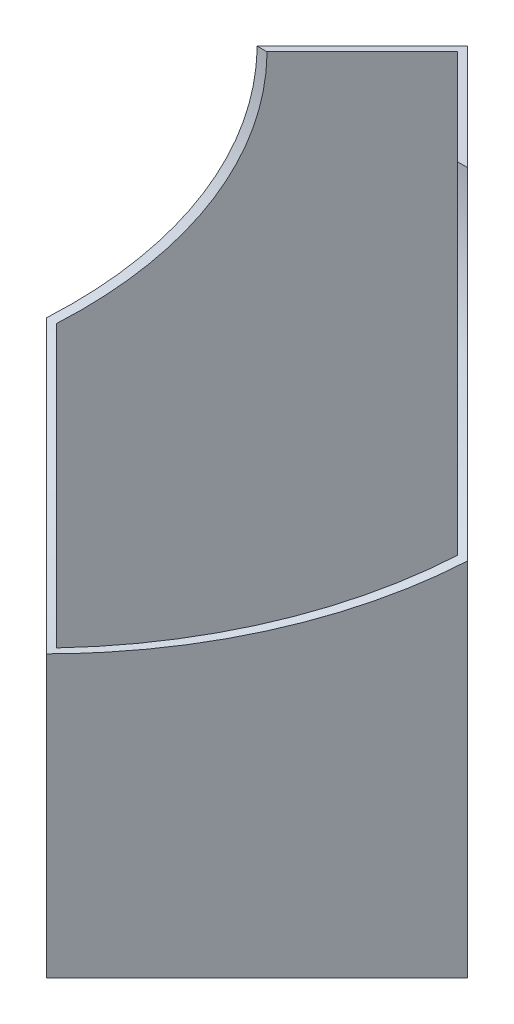
ISO-10303-21;
HEADER;
FILE_DESCRIPTION(('STEP AP214'),'2;1');
FILE_NAME('part.step','',(''),(''),'','','');
FILE_SCHEMA(('AUTOMOTIVE_DESIGN { 1 0 10303 214 1 1 1 1 }'));
ENDSEC;
DATA;
#1=APPLICATION_CONTEXT('core data for automotive mechanical design processes');
#2=APPLICATION_PROTOCOL_DEFINITION('international standard','automotive_design',2000,#1);
#3=PRODUCT_CONTEXT('',#1,'mechanical');
#4=PRODUCT('Part','Part','',(#3));
#5=PRODUCT_RELATED_PRODUCT_CATEGORY('part','',(#4));
#6=PRODUCT_DEFINITION_FORMATION('','',#4);
#7=PRODUCT_DEFINITION_CONTEXT('part definition',#1,'design');
#8=PRODUCT_DEFINITION('design','',#6,#7);
#9=PRODUCT_DEFINITION_SHAPE('','',#8);
#10=(LENGTH_UNIT() NAMED_UNIT(*) SI_UNIT(.MILLI.,.METRE.));
#11=(NAMED_UNIT(*) PLANE_ANGLE_UNIT() SI_UNIT($,.RADIAN.));
#12=(NAMED_UNIT(*) SI_UNIT($,.STERADIAN.) SOLID_ANGLE_UNIT());
#13=UNCERTAINTY_MEASURE_WITH_UNIT(LENGTH_MEASURE(1.E-05),#10,'distance_accuracy_value','');
#14=(GEOMETRIC_REPRESENTATION_CONTEXT(3) GLOBAL_UNCERTAINTY_ASSIGNED_CONTEXT((#13)) GLOBAL_UNIT_ASSIGNED_CONTEXT((#10,
#11,#12)) REPRESENTATION_CONTEXT('',''));
#15=CARTESIAN_POINT('',(0.,0.,0.));
#16=DIRECTION('',(0.,0.,1.));
#17=DIRECTION('',(1.,0.,0.));
#18=AXIS2_PLACEMENT_3D('',#15,#16,#17);
#19=CARTESIAN_POINT('',(0.,85.,-30.));
#20=DIRECTION('',(0.,-1.,0.));
#21=DIRECTION('',(0.,0.,-1.));
#22=AXIS2_PLACEMENT_3D('',#19,#20,#21);
#23=PLANE('',#22);
#24=DIRECTION('',(-0.707106781186547,0.,0.707106781186547));
#25=VECTOR('',#24,1.);
#26=CARTESIAN_POINT('',(-30.,85.,0.));
#27=LINE('',#26,#25);
#28=CARTESIAN_POINT('',(0.,85.,-30.));
#29=VERTEX_POINT('',#28);
#30=CARTESIAN_POINT('',(-15.,85.,-15.));
#31=VERTEX_POINT('',#30);
#32=EDGE_CURVE('E139',#29,#31,#27,.T.);
#33=ORIENTED_EDGE('',*,*,#32,.T.);
#34=DIRECTION('',(1.,0.,0.));
#35=VECTOR('',#34,1.);
#36=CARTESIAN_POINT('',(-30.,85.,-15.));
#37=LINE('',#36,#35);
#38=CARTESIAN_POINT('',(-13.5857864376269,85.,-15.));
#39=VERTEX_POINT('',#38);
#40=EDGE_CURVE('E112',#31,#39,#37,.T.);
#41=ORIENTED_EDGE('',*,*,#40,.T.);
#42=DIRECTION('',(-0.707106781186548,0.,0.707106781186548));
#43=VECTOR('',#42,1.);
#44=CARTESIAN_POINT('',(0.707106781186548,85.,-29.2928932188135));
#45=LINE('',#44,#43);
#46=CARTESIAN_POINT('',(0.,85.,-28.5857864376269));
#47=VERTEX_POINT('',#46);
#48=EDGE_CURVE('E153',#47,#39,#45,.T.);
#49=ORIENTED_EDGE('',*,*,#48,.F.);
#50=DIRECTION('',(-0.707106781186548,0.,-0.707106781186548));
#51=VECTOR('',#50,1.);
#52=CARTESIAN_POINT('',(-0.707106781186548,85.,-29.2928932188135));
#53=LINE('',#52,#51);
#54=CARTESIAN_POINT('',(13.5857864376269,85.,-15.));
#55=VERTEX_POINT('',#54);
#56=EDGE_CURVE('E150',#55,#47,#53,.T.);
#57=ORIENTED_EDGE('',*,*,#56,.F.);
#58=CARTESIAN_POINT('',(15.,85.,-15.));
#59=VERTEX_POINT('',#58);
#60=EDGE_CURVE('E44',#55,#59,#37,.T.);
#61=ORIENTED_EDGE('',*,*,#60,.T.);
#62=DIRECTION('',(-0.707106781186547,0.,-0.707106781186547));
#63=VECTOR('',#62,1.);
#64=CARTESIAN_POINT('',(0.,85.,-30.));
#65=LINE('',#64,#63);
#66=EDGE_CURVE('E137',#59,#29,#65,.T.);
#67=ORIENTED_EDGE('',*,*,#66,.T.);
#68=EDGE_LOOP('',(#33,#41,#49,#57,#61,#67));
#69=FACE_BOUND('',#68,.T.);
#70=ADVANCED_FACE('F30',(#69),#23,.F.);
#71=CARTESIAN_POINT('',(0.,0.,-30.));
#72=DIRECTION('',(0.,-1.,0.));
#73=DIRECTION('',(0.,0.,-1.));
#74=AXIS2_PLACEMENT_3D('',#71,#72,#73);
#75=PLANE('',#74);
#76=DIRECTION('',(-0.707106781186547,0.,0.707106781186547));
#77=VECTOR('',#76,1.);
#78=CARTESIAN_POINT('',(-30.,0.,0.));
#79=LINE('',#78,#77);
#80=CARTESIAN_POINT('',(0.,0.,-30.));
#81=VERTEX_POINT('',#80);
#82=CARTESIAN_POINT('',(-30.,0.,0.));
#83=VERTEX_POINT('',#82);
#84=EDGE_CURVE('E130',#81,#83,#79,.T.);
#85=ORIENTED_EDGE('',*,*,#84,.F.);
#86=DIRECTION('',(-0.707106781186547,0.,-0.707106781186547));
#87=VECTOR('',#86,1.);
#88=CARTESIAN_POINT('',(0.,0.,-30.));
#89=LINE('',#88,#87);
#90=CARTESIAN_POINT('',(30.,0.,0.));
#91=VERTEX_POINT('',#90);
#92=EDGE_CURVE('E141',#91,#81,#89,.T.);
#93=ORIENTED_EDGE('',*,*,#92,.F.);
#94=DIRECTION('',(0.707106781186547,0.,-0.707106781186547));
#95=VECTOR('',#94,1.);
#96=CARTESIAN_POINT('',(30.,0.,0.));
#97=LINE('',#96,#95);
#98=CARTESIAN_POINT('',(0.,0.,30.));
#99=VERTEX_POINT('',#98);
#100=EDGE_CURVE('E143',#99,#91,#97,.T.);
#101=ORIENTED_EDGE('',*,*,#100,.F.);
#102=DIRECTION('',(0.707106781186547,0.,0.707106781186547));
#103=VECTOR('',#102,1.);
#104=CARTESIAN_POINT('',(0.,0.,30.));
#105=LINE('',#104,#103);
#106=EDGE_CURVE('E146',#83,#99,#105,.T.);
#107=ORIENTED_EDGE('',*,*,#106,.F.);
#108=EDGE_LOOP('',(#85,#93,#101,#107));
#109=FACE_BOUND('',#108,.T.);
#110=DIRECTION('',(-0.707106781186548,0.,-0.707106781186548));
#111=VECTOR('',#110,1.);
#112=CARTESIAN_POINT('',(-0.707106781186548,0.,-29.2928932188135));
#113=LINE('',#112,#111);
#114=CARTESIAN_POINT('',(28.5857864376269,0.,0.));
#115=VERTEX_POINT('',#114);
#116=CARTESIAN_POINT('',(0.,0.,-28.5857864376269));
#117=VERTEX_POINT('',#116);
#118=EDGE_CURVE('E156',#115,#117,#113,.T.);
#119=ORIENTED_EDGE('',*,*,#118,.T.);
#120=DIRECTION('',(-0.707106781186548,0.,0.707106781186548));
#121=VECTOR('',#120,1.);
#122=CARTESIAN_POINT('',(0.707106781186548,0.,-29.2928932188135));
#123=LINE('',#122,#121);
#124=CARTESIAN_POINT('',(-28.5857864376269,0.,0.));
#125=VERTEX_POINT('',#124);
#126=EDGE_CURVE('E117',#117,#125,#123,.T.);
#127=ORIENTED_EDGE('',*,*,#126,.T.);
#128=DIRECTION('',(0.707106781186548,0.,0.707106781186548));
#129=VECTOR('',#128,1.);
#130=CARTESIAN_POINT('',(-29.2928932188135,0.,-0.707106781186548));
#131=LINE('',#130,#129);
#132=CARTESIAN_POINT('',(0.,0.,28.5857864376269));
#133=VERTEX_POINT('',#132);
#134=EDGE_CURVE('E157',#125,#133,#131,.T.);
#135=ORIENTED_EDGE('',*,*,#134,.T.);
#136=DIRECTION('',(0.707106781186548,0.,-0.707106781186548));
#137=VECTOR('',#136,1.);
#138=CARTESIAN_POINT('',(29.2928932188135,0.,-0.707106781186548));
#139=LINE('',#138,#137);
#140=EDGE_CURVE('E160',#133,#115,#139,.T.);
#141=ORIENTED_EDGE('',*,*,#140,.T.);
#142=EDGE_LOOP('',(#119,#127,#135,#141));
#143=FACE_BOUND('',#142,.T.);
#144=ADVANCED_FACE('F191',(#109,#143),#75,.T.);
#145=CARTESIAN_POINT('',(-30.,85.,0.));
#146=DIRECTION('',(0.707106781186547,0.,0.707106781186547));
#147=DIRECTION('',(0.707106781186548,0.,-0.707106781186548));
#148=AXIS2_PLACEMENT_3D('',#145,#146,#147);
#149=PLANE('',#148);
#150=DIRECTION('',(0.,-1.,0.));
#151=VECTOR('',#150,1.);
#152=CARTESIAN_POINT('',(-30.,85.,0.));
#153=LINE('',#152,#151);
#154=CARTESIAN_POINT('',(-30.,51.4589803375032,0.));
#155=VERTEX_POINT('',#154);
#156=EDGE_CURVE('E38',#155,#83,#153,.T.);
#157=ORIENTED_EDGE('',*,*,#156,.F.);
#158=CARTESIAN_POINT('',(-60.,85.,30.));
#159=DIRECTION('',(0.707106781186547,0.,0.707106781186547));
#160=DIRECTION('',(0.707106781186548,0.,-0.707106781186548));
#161=AXIS2_PLACEMENT_3D('',#158,#159,#160);
#162=ELLIPSE('',#161,63.6396103067893,45.);
#163=EDGE_CURVE('E106',#155,#31,#162,.T.);
#164=ORIENTED_EDGE('',*,*,#163,.T.);
#165=ORIENTED_EDGE('',*,*,#32,.F.);
#166=DIRECTION('',(0.,-1.,0.));
#167=VECTOR('',#166,1.);
#168=CARTESIAN_POINT('',(0.,85.,-30.));
#169=LINE('',#168,#167);
#170=EDGE_CURVE('E135',#29,#81,#169,.T.);
#171=ORIENTED_EDGE('',*,*,#170,.T.);
#172=ORIENTED_EDGE('',*,*,#84,.T.);
#173=EDGE_LOOP('',(#157,#164,#165,#171,#172));
#174=FACE_BOUND('',#173,.T.);
#175=ADVANCED_FACE('F32',(#174),#149,.F.);
#176=CARTESIAN_POINT('',(0.,85.,30.));
#177=DIRECTION('',(0.707106781186547,0.,-0.707106781186547));
#178=DIRECTION('',(-0.707106781186548,0.,-0.707106781186548));
#179=AXIS2_PLACEMENT_3D('',#176,#177,#178);
#180=PLANE('',#179);
#181=DIRECTION('',(0.,-1.,0.));
#182=VECTOR('',#181,1.);
#183=CARTESIAN_POINT('',(0.,85.,30.));
#184=LINE('',#183,#182);
#185=CARTESIAN_POINT('',(0.,40.,30.));
#186=VERTEX_POINT('',#185);
#187=EDGE_CURVE('E124',#186,#99,#184,.T.);
#188=ORIENTED_EDGE('',*,*,#187,.F.);
#189=CARTESIAN_POINT('',(0.,85.,30.));
#190=DIRECTION('',(0.707106781186547,0.,-0.707106781186547));
#191=DIRECTION('',(0.707106781186548,0.,0.707106781186548));
#192=AXIS2_PLACEMENT_3D('',#189,#190,#191);
#193=ELLIPSE('',#192,63.6396103067893,45.);
#194=EDGE_CURVE('E109',#186,#155,#193,.T.);
#195=ORIENTED_EDGE('',*,*,#194,.T.);
#196=ORIENTED_EDGE('',*,*,#156,.T.);
#197=ORIENTED_EDGE('',*,*,#106,.T.);
#198=EDGE_LOOP('',(#188,#195,#196,#197));
#199=FACE_BOUND('',#198,.T.);
#200=ADVANCED_FACE('F121',(#199),#180,.F.);
#201=CARTESIAN_POINT('',(30.,85.,0.));
#202=DIRECTION('',(-0.707106781186547,0.,-0.707106781186547));
#203=DIRECTION('',(-0.707106781186548,0.,0.707106781186548));
#204=AXIS2_PLACEMENT_3D('',#201,#202,#203);
#205=PLANE('',#204);
#206=DIRECTION('',(0.,-1.,0.));
#207=VECTOR('',#206,1.);
#208=CARTESIAN_POINT('',(30.,85.,0.));
#209=LINE('',#208,#207);
#210=CARTESIAN_POINT('',(30.,51.4589803375032,0.));
#211=VERTEX_POINT('',#210);
#212=EDGE_CURVE('E131',#211,#91,#209,.T.);
#213=ORIENTED_EDGE('',*,*,#212,.F.);
#214=CARTESIAN_POINT('',(0.,85.,30.));
#215=DIRECTION('',(-0.707106781186547,0.,-0.707106781186547));
#216=DIRECTION('',(0.707106781186548,0.,-0.707106781186548));
#217=AXIS2_PLACEMENT_3D('',#214,#215,#216);
#218=ELLIPSE('',#217,63.6396103067893,45.);
#219=EDGE_CURVE('E125',#211,#186,#218,.T.);
#220=ORIENTED_EDGE('',*,*,#219,.T.);
#221=ORIENTED_EDGE('',*,*,#187,.T.);
#222=ORIENTED_EDGE('',*,*,#100,.T.);
#223=EDGE_LOOP('',(#213,#220,#221,#222));
#224=FACE_BOUND('',#223,.T.);
#225=ADVANCED_FACE('F207',(#224),#205,.F.);
#226=CARTESIAN_POINT('',(0.,85.,-30.));
#227=DIRECTION('',(-0.707106781186547,0.,0.707106781186547));
#228=DIRECTION('',(0.707106781186548,0.,0.707106781186548));
#229=AXIS2_PLACEMENT_3D('',#226,#227,#228);
#230=PLANE('',#229);
#231=ORIENTED_EDGE('',*,*,#66,.F.);
#232=CARTESIAN_POINT('',(60.,85.,30.));
#233=DIRECTION('',(-0.707106781186547,0.,0.707106781186547));
#234=DIRECTION('',(0.707106781186548,0.,0.707106781186548));
#235=AXIS2_PLACEMENT_3D('',#232,#233,#234);
#236=ELLIPSE('',#235,63.6396103067893,45.);
#237=EDGE_CURVE('E173',#59,#211,#236,.T.);
#238=ORIENTED_EDGE('',*,*,#237,.T.);
#239=ORIENTED_EDGE('',*,*,#212,.T.);
#240=ORIENTED_EDGE('',*,*,#92,.T.);
#241=ORIENTED_EDGE('',*,*,#170,.F.);
#242=EDGE_LOOP('',(#231,#238,#239,#240,#241));
#243=FACE_BOUND('',#242,.T.);
#244=ADVANCED_FACE('F208',(#243),#230,.F.);
#245=CARTESIAN_POINT('',(-29.2928932188135,85.,0.707106781186547));
#246=DIRECTION('',(0.707106781186547,0.,0.707106781186547));
#247=DIRECTION('',(0.707106781186548,0.,-0.707106781186548));
#248=AXIS2_PLACEMENT_3D('',#245,#246,#247);
#249=PLANE('',#248);
#250=CARTESIAN_POINT('',(-58.5857864376269,85.,30.));
#251=DIRECTION('',(0.707106781186547,0.,0.707106781186547));
#252=DIRECTION('',(0.707106781186548,0.,-0.707106781186548));
#253=AXIS2_PLACEMENT_3D('',#250,#251,#252);
#254=ELLIPSE('',#253,63.6396103067893,45.);
#255=CARTESIAN_POINT('',(-28.5857864376269,51.4589803375032,0.));
#256=VERTEX_POINT('',#255);
#257=EDGE_CURVE('E177',#256,#39,#254,.T.);
#258=ORIENTED_EDGE('',*,*,#257,.F.);
#259=DIRECTION('',(0.,-1.,0.));
#260=VECTOR('',#259,1.);
#261=CARTESIAN_POINT('',(-28.5857864376269,85.,0.));
#262=LINE('',#261,#260);
#263=EDGE_CURVE('E149',#256,#125,#262,.T.);
#264=ORIENTED_EDGE('',*,*,#263,.T.);
#265=ORIENTED_EDGE('',*,*,#126,.F.);
#266=DIRECTION('',(0.,-1.,0.));
#267=VECTOR('',#266,1.);
#268=CARTESIAN_POINT('',(0.,85.,-28.5857864376269));
#269=LINE('',#268,#267);
#270=EDGE_CURVE('E152',#47,#117,#269,.T.);
#271=ORIENTED_EDGE('',*,*,#270,.F.);
#272=ORIENTED_EDGE('',*,*,#48,.T.);
#273=EDGE_LOOP('',(#258,#264,#265,#271,#272));
#274=FACE_BOUND('',#273,.T.);
#275=ADVANCED_FACE('F195',(#274),#249,.T.);
#276=CARTESIAN_POINT('',(0.707106781186547,85.,29.2928932188135));
#277=DIRECTION('',(0.707106781186547,0.,-0.707106781186547));
#278=DIRECTION('',(-0.707106781186548,0.,-0.707106781186548));
#279=AXIS2_PLACEMENT_3D('',#276,#277,#278);
#280=PLANE('',#279);
#281=CARTESIAN_POINT('',(1.4142135623731,85.,30.));
#282=DIRECTION('',(0.707106781186547,0.,-0.707106781186547));
#283=DIRECTION('',(0.707106781186548,0.,0.707106781186548));
#284=AXIS2_PLACEMENT_3D('',#281,#282,#283);
#285=ELLIPSE('',#284,63.6396103067893,45.);
#286=CARTESIAN_POINT('',(0.,40.022227711902,28.5857864376269));
#287=VERTEX_POINT('',#286);
#288=EDGE_CURVE('E179',#287,#256,#285,.T.);
#289=ORIENTED_EDGE('',*,*,#288,.F.);
#290=DIRECTION('',(0.,-1.,0.));
#291=VECTOR('',#290,1.);
#292=CARTESIAN_POINT('',(0.,85.,28.5857864376269));
#293=LINE('',#292,#291);
#294=EDGE_CURVE('E52',#287,#133,#293,.T.);
#295=ORIENTED_EDGE('',*,*,#294,.T.);
#296=ORIENTED_EDGE('',*,*,#134,.F.);
#297=ORIENTED_EDGE('',*,*,#263,.F.);
#298=EDGE_LOOP('',(#289,#295,#296,#297));
#299=FACE_BOUND('',#298,.T.);
#300=ADVANCED_FACE('F187',(#299),#280,.T.);
#301=CARTESIAN_POINT('',(29.2928932188135,85.,-0.707106781186547));
#302=DIRECTION('',(-0.707106781186547,0.,-0.707106781186547));
#303=DIRECTION('',(-0.707106781186548,0.,0.707106781186548));
#304=AXIS2_PLACEMENT_3D('',#301,#302,#303);
#305=PLANE('',#304);
#306=CARTESIAN_POINT('',(-1.4142135623731,85.,30.));
#307=DIRECTION('',(-0.707106781186547,0.,-0.707106781186547));
#308=DIRECTION('',(0.707106781186548,0.,-0.707106781186548));
#309=AXIS2_PLACEMENT_3D('',#306,#307,#308);
#310=ELLIPSE('',#309,63.6396103067893,45.);
#311=CARTESIAN_POINT('',(28.5857864376269,51.4589803375032,0.));
#312=VERTEX_POINT('',#311);
#313=EDGE_CURVE('E181',#312,#287,#310,.T.);
#314=ORIENTED_EDGE('',*,*,#313,.F.);
#315=DIRECTION('',(0.,-1.,0.));
#316=VECTOR('',#315,1.);
#317=CARTESIAN_POINT('',(28.5857864376269,85.,0.));
#318=LINE('',#317,#316);
#319=EDGE_CURVE('E167',#312,#115,#318,.T.);
#320=ORIENTED_EDGE('',*,*,#319,.T.);
#321=ORIENTED_EDGE('',*,*,#140,.F.);
#322=ORIENTED_EDGE('',*,*,#294,.F.);
#323=EDGE_LOOP('',(#314,#320,#321,#322));
#324=FACE_BOUND('',#323,.T.);
#325=ADVANCED_FACE('F188',(#324),#305,.T.);
#326=CARTESIAN_POINT('',(-0.707106781186547,85.,-29.2928932188135));
#327=DIRECTION('',(-0.707106781186547,0.,0.707106781186547));
#328=DIRECTION('',(0.707106781186548,0.,0.707106781186548));
#329=AXIS2_PLACEMENT_3D('',#326,#327,#328);
#330=PLANE('',#329);
#331=CARTESIAN_POINT('',(58.5857864376269,85.,30.));
#332=DIRECTION('',(-0.707106781186547,0.,0.707106781186547));
#333=DIRECTION('',(0.707106781186548,0.,0.707106781186548));
#334=AXIS2_PLACEMENT_3D('',#331,#332,#333);
#335=ELLIPSE('',#334,63.6396103067893,45.);
#336=EDGE_CURVE('E11',#55,#312,#335,.T.);
#337=ORIENTED_EDGE('',*,*,#336,.F.);
#338=ORIENTED_EDGE('',*,*,#56,.T.);
#339=ORIENTED_EDGE('',*,*,#270,.T.);
#340=ORIENTED_EDGE('',*,*,#118,.F.);
#341=ORIENTED_EDGE('',*,*,#319,.F.);
#342=EDGE_LOOP('',(#337,#338,#339,#340,#341));
#343=FACE_BOUND('',#342,.T.);
#344=ADVANCED_FACE('F224',(#343),#330,.T.);
#345=CARTESIAN_POINT('',(-30.,85.,30.));
#346=DIRECTION('',(1.,0.,0.));
#347=DIRECTION('',(0.,0.,-1.));
#348=AXIS2_PLACEMENT_3D('',#345,#346,#347);
#349=CYLINDRICAL_SURFACE('',#348,45.);
#350=ORIENTED_EDGE('',*,*,#194,.F.);
#351=ORIENTED_EDGE('',*,*,#219,.F.);
#352=ORIENTED_EDGE('',*,*,#237,.F.);
#353=ORIENTED_EDGE('',*,*,#60,.F.);
#354=ORIENTED_EDGE('',*,*,#336,.T.);
#355=ORIENTED_EDGE('',*,*,#313,.T.);
#356=ORIENTED_EDGE('',*,*,#288,.T.);
#357=ORIENTED_EDGE('',*,*,#257,.T.);
#358=ORIENTED_EDGE('',*,*,#40,.F.);
#359=ORIENTED_EDGE('',*,*,#163,.F.);
#360=EDGE_LOOP('',(#350,#351,#352,#353,#354,#355,#356,#357,#358,#359));
#361=FACE_BOUND('',#360,.T.);
#362=ADVANCED_FACE('F108',(#361),#349,.F.);
#363=CLOSED_SHELL('',(#70,#144,#175,#200,#225,#244,#275,#300,#325,#344,#362));
#364=MANIFOLD_SOLID_BREP('B2',#363);
#365=ADVANCED_BREP_SHAPE_REPRESENTATION('',(#18,#364),#14);
#366=SHAPE_DEFINITION_REPRESENTATION(#9,#365);
ENDSEC;
END-ISO-10303-21;
